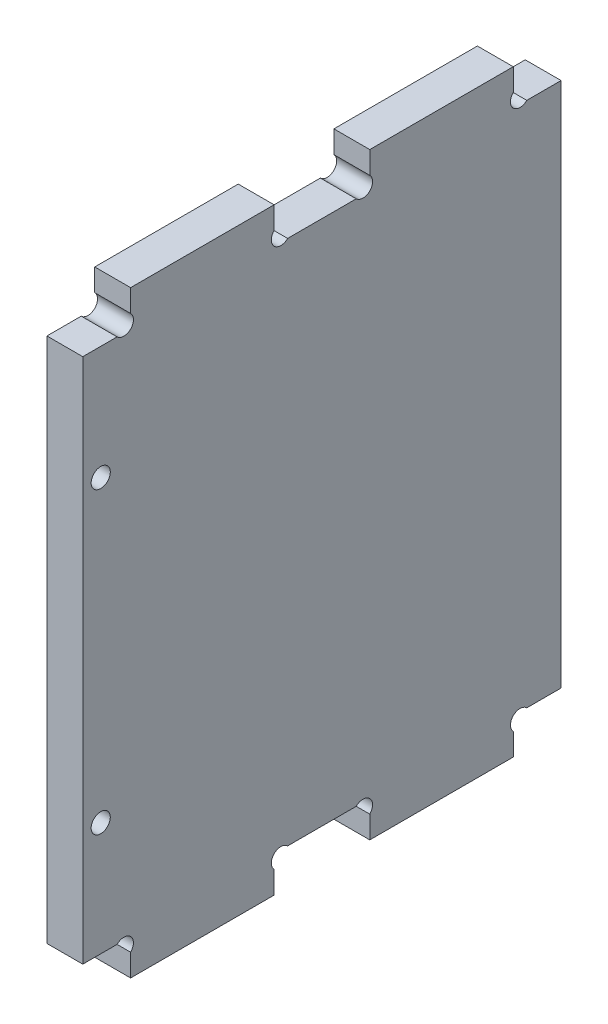
ISO-10303-21;
HEADER;
FILE_DESCRIPTION(('STEP AP214'),'2;1');
FILE_NAME('part.step','',(''),(''),'','','');
FILE_SCHEMA(('AUTOMOTIVE_DESIGN { 1 0 10303 214 1 1 1 1 }'));
ENDSEC;
DATA;
#1=APPLICATION_CONTEXT('core data for automotive mechanical design processes');
#2=APPLICATION_PROTOCOL_DEFINITION('international standard','automotive_design',2000,#1);
#3=PRODUCT_CONTEXT('',#1,'mechanical');
#4=PRODUCT('Part','Part','',(#3));
#5=PRODUCT_RELATED_PRODUCT_CATEGORY('part','',(#4));
#6=PRODUCT_DEFINITION_FORMATION('','',#4);
#7=PRODUCT_DEFINITION_CONTEXT('part definition',#1,'design');
#8=PRODUCT_DEFINITION('design','',#6,#7);
#9=PRODUCT_DEFINITION_SHAPE('','',#8);
#10=(LENGTH_UNIT() NAMED_UNIT(*) SI_UNIT(.MILLI.,.METRE.));
#11=(NAMED_UNIT(*) PLANE_ANGLE_UNIT() SI_UNIT($,.RADIAN.));
#12=(NAMED_UNIT(*) SI_UNIT($,.STERADIAN.) SOLID_ANGLE_UNIT());
#13=UNCERTAINTY_MEASURE_WITH_UNIT(LENGTH_MEASURE(1.E-05),#10,'distance_accuracy_value','');
#14=(GEOMETRIC_REPRESENTATION_CONTEXT(3) GLOBAL_UNCERTAINTY_ASSIGNED_CONTEXT((#13)) GLOBAL_UNIT_ASSIGNED_CONTEXT((#10,
#11,#12)) REPRESENTATION_CONTEXT('',''));
#15=CARTESIAN_POINT('',(0.,0.,0.));
#16=DIRECTION('',(0.,0.,1.));
#17=DIRECTION('',(1.,0.,0.));
#18=AXIS2_PLACEMENT_3D('',#15,#16,#17);
#19=CARTESIAN_POINT('',(6.,95.1313708498985,-6.86862915010144));
#20=DIRECTION('',(1.,0.,0.));
#21=DIRECTION('',(0.,0.,-1.));
#22=AXIS2_PLACEMENT_3D('',#19,#20,#21);
#23=PLANE('',#22);
#24=CARTESIAN_POINT('',(6.,25.,-3.));
#25=DIRECTION('',(1.,0.,0.));
#26=DIRECTION('',(0.,0.,-1.));
#27=AXIS2_PLACEMENT_3D('',#24,#25,#26);
#28=CIRCLE('',#27,1.6);
#29=CARTESIAN_POINT('',(6.,25.,-4.6));
#30=VERTEX_POINT('',#29);
#31=EDGE_CURVE('E230',#30,#30,#28,.T.);
#32=ORIENTED_EDGE('',*,*,#31,.F.);
#33=EDGE_LOOP('',(#32));
#34=FACE_BOUND('',#33,.T.);
#35=CARTESIAN_POINT('',(6.,95.1313708498985,-6.86862915010144));
#36=DIRECTION('',(-1.,0.,0.));
#37=DIRECTION('',(0.,0.,-1.));
#38=AXIS2_PLACEMENT_3D('',#35,#36,#37);
#39=CIRCLE('',#38,1.60000000000011);
#40=CARTESIAN_POINT('',(6.,96.2627416997971,-8.00000000000001));
#41=VERTEX_POINT('',#40);
#42=CARTESIAN_POINT('',(6.,94.,-5.73725830020288));
#43=VERTEX_POINT('',#42);
#44=EDGE_CURVE('E288',#41,#43,#39,.T.);
#45=ORIENTED_EDGE('',*,*,#44,.T.);
#46=DIRECTION('',(0.,0.,1.));
#47=VECTOR('',#46,1.);
#48=CARTESIAN_POINT('',(6.,94.,0.));
#49=LINE('',#48,#47);
#50=CARTESIAN_POINT('',(6.,94.,0.));
#51=VERTEX_POINT('',#50);
#52=EDGE_CURVE('E225',#43,#51,#49,.T.);
#53=ORIENTED_EDGE('',*,*,#52,.T.);
#54=DIRECTION('',(0.,-1.,0.));
#55=VECTOR('',#54,1.);
#56=CARTESIAN_POINT('',(6.,6.00000000000003,0.));
#57=LINE('',#56,#55);
#58=CARTESIAN_POINT('',(6.,6.00000000000003,0.));
#59=VERTEX_POINT('',#58);
#60=EDGE_CURVE('E291',#51,#59,#57,.T.);
#61=ORIENTED_EDGE('',*,*,#60,.T.);
#62=DIRECTION('',(0.,0.,-1.));
#63=VECTOR('',#62,1.);
#64=CARTESIAN_POINT('',(6.,6.00000000000003,0.));
#65=LINE('',#64,#63);
#66=CARTESIAN_POINT('',(6.,6.00000000000002,-5.7372583002029));
#67=VERTEX_POINT('',#66);
#68=EDGE_CURVE('E293',#59,#67,#65,.T.);
#69=ORIENTED_EDGE('',*,*,#68,.T.);
#70=CARTESIAN_POINT('',(6.,4.86862915010146,-6.86862915010143));
#71=DIRECTION('',(-1.,0.,0.));
#72=DIRECTION('',(0.,0.,1.));
#73=AXIS2_PLACEMENT_3D('',#70,#71,#72);
#74=CIRCLE('',#73,1.6000000000001);
#75=CARTESIAN_POINT('',(6.,3.73725830020293,-8.));
#76=VERTEX_POINT('',#75);
#77=EDGE_CURVE('E295',#67,#76,#74,.T.);
#78=ORIENTED_EDGE('',*,*,#77,.T.);
#79=DIRECTION('',(0.,-1.,0.));
#80=VECTOR('',#79,1.);
#81=CARTESIAN_POINT('',(6.,3.73725830020293,-8.00000000000001));
#82=LINE('',#81,#80);
#83=CARTESIAN_POINT('',(6.,0.,-8.));
#84=VERTEX_POINT('',#83);
#85=EDGE_CURVE('E297',#76,#84,#82,.T.);
#86=ORIENTED_EDGE('',*,*,#85,.T.);
#87=DIRECTION('',(0.,0.,-1.));
#88=VECTOR('',#87,1.);
#89=CARTESIAN_POINT('',(6.,0.,-8.));
#90=LINE('',#89,#88);
#91=CARTESIAN_POINT('',(6.,0.,-32.));
#92=VERTEX_POINT('',#91);
#93=EDGE_CURVE('E299',#84,#92,#90,.T.);
#94=ORIENTED_EDGE('',*,*,#93,.T.);
#95=DIRECTION('',(0.,1.,0.));
#96=VECTOR('',#95,1.);
#97=CARTESIAN_POINT('',(6.,0.,-32.));
#98=LINE('',#97,#96);
#99=CARTESIAN_POINT('',(6.,3.73725830020294,-32.));
#100=VERTEX_POINT('',#99);
#101=EDGE_CURVE('E301',#92,#100,#98,.T.);
#102=ORIENTED_EDGE('',*,*,#101,.T.);
#103=CARTESIAN_POINT('',(6.,4.86862915010146,-33.1313708498986));
#104=DIRECTION('',(-1.,0.,0.));
#105=DIRECTION('',(0.,0.,-1.));
#106=AXIS2_PLACEMENT_3D('',#103,#104,#105);
#107=CIRCLE('',#106,1.6000000000001);
#108=CARTESIAN_POINT('',(6.,6.00000000000003,-34.2627416997971));
#109=VERTEX_POINT('',#108);
#110=EDGE_CURVE('E303',#100,#109,#107,.T.);
#111=ORIENTED_EDGE('',*,*,#110,.T.);
#112=DIRECTION('',(0.,0.,-1.));
#113=VECTOR('',#112,1.);
#114=CARTESIAN_POINT('',(6.,6.00000000000002,-34.2627416997971));
#115=LINE('',#114,#113);
#116=CARTESIAN_POINT('',(6.,6.00000000000002,-45.7372583002029));
#117=VERTEX_POINT('',#116);
#118=EDGE_CURVE('E305',#109,#117,#115,.T.);
#119=ORIENTED_EDGE('',*,*,#118,.T.);
#120=CARTESIAN_POINT('',(6.,4.86862915010146,-46.8686291501014));
#121=DIRECTION('',(-1.,0.,0.));
#122=DIRECTION('',(0.,0.,1.));
#123=AXIS2_PLACEMENT_3D('',#120,#121,#122);
#124=CIRCLE('',#123,1.6000000000001);
#125=CARTESIAN_POINT('',(6.,3.73725830020294,-48.));
#126=VERTEX_POINT('',#125);
#127=EDGE_CURVE('E307',#117,#126,#124,.T.);
#128=ORIENTED_EDGE('',*,*,#127,.T.);
#129=DIRECTION('',(0.,-1.,0.));
#130=VECTOR('',#129,1.);
#131=CARTESIAN_POINT('',(6.,0.,-48.));
#132=LINE('',#131,#130);
#133=CARTESIAN_POINT('',(6.,0.,-48.));
#134=VERTEX_POINT('',#133);
#135=EDGE_CURVE('E309',#126,#134,#132,.T.);
#136=ORIENTED_EDGE('',*,*,#135,.T.);
#137=DIRECTION('',(0.,0.,-1.));
#138=VECTOR('',#137,1.);
#139=CARTESIAN_POINT('',(6.,0.,-72.));
#140=LINE('',#139,#138);
#141=CARTESIAN_POINT('',(6.,0.,-72.));
#142=VERTEX_POINT('',#141);
#143=EDGE_CURVE('E311',#134,#142,#140,.T.);
#144=ORIENTED_EDGE('',*,*,#143,.T.);
#145=DIRECTION('',(0.,1.,0.));
#146=VECTOR('',#145,1.);
#147=CARTESIAN_POINT('',(6.,3.73725830020293,-72.));
#148=LINE('',#147,#146);
#149=CARTESIAN_POINT('',(6.,3.73725830020293,-72.));
#150=VERTEX_POINT('',#149);
#151=EDGE_CURVE('E313',#142,#150,#148,.T.);
#152=ORIENTED_EDGE('',*,*,#151,.T.);
#153=CARTESIAN_POINT('',(6.,4.86862915010146,-73.1313708498986));
#154=DIRECTION('',(-1.,0.,0.));
#155=DIRECTION('',(0.,0.,-1.));
#156=AXIS2_PLACEMENT_3D('',#153,#154,#155);
#157=CIRCLE('',#156,1.6000000000001);
#158=CARTESIAN_POINT('',(6.,6.00000000000002,-74.2627416997971));
#159=VERTEX_POINT('',#158);
#160=EDGE_CURVE('E315',#150,#159,#157,.T.);
#161=ORIENTED_EDGE('',*,*,#160,.T.);
#162=DIRECTION('',(0.,0.,-1.));
#163=VECTOR('',#162,1.);
#164=CARTESIAN_POINT('',(6.,6.,-80.));
#165=LINE('',#164,#163);
#166=CARTESIAN_POINT('',(6.,6.,-80.));
#167=VERTEX_POINT('',#166);
#168=EDGE_CURVE('E317',#159,#167,#165,.T.);
#169=ORIENTED_EDGE('',*,*,#168,.T.);
#170=DIRECTION('',(0.,1.,0.));
#171=VECTOR('',#170,1.);
#172=CARTESIAN_POINT('',(6.,94.,-80.));
#173=LINE('',#172,#171);
#174=CARTESIAN_POINT('',(6.,94.,-80.));
#175=VERTEX_POINT('',#174);
#176=EDGE_CURVE('E319',#167,#175,#173,.T.);
#177=ORIENTED_EDGE('',*,*,#176,.T.);
#178=DIRECTION('',(0.,0.,1.));
#179=VECTOR('',#178,1.);
#180=CARTESIAN_POINT('',(6.,94.,-80.));
#181=LINE('',#180,#179);
#182=CARTESIAN_POINT('',(6.,94.,-74.2627416997971));
#183=VERTEX_POINT('',#182);
#184=EDGE_CURVE('E321',#175,#183,#181,.T.);
#185=ORIENTED_EDGE('',*,*,#184,.T.);
#186=CARTESIAN_POINT('',(6.,95.1313708498985,-73.1313708498986));
#187=DIRECTION('',(-1.,0.,0.));
#188=DIRECTION('',(0.,0.,1.));
#189=AXIS2_PLACEMENT_3D('',#186,#187,#188);
#190=CIRCLE('',#189,1.60000000000011);
#191=CARTESIAN_POINT('',(6.,96.2627416997971,-72.));
#192=VERTEX_POINT('',#191);
#193=EDGE_CURVE('E323',#183,#192,#190,.T.);
#194=ORIENTED_EDGE('',*,*,#193,.T.);
#195=DIRECTION('',(0.,1.,0.));
#196=VECTOR('',#195,1.);
#197=CARTESIAN_POINT('',(6.,96.2627416997971,-72.));
#198=LINE('',#197,#196);
#199=CARTESIAN_POINT('',(6.,100.,-72.));
#200=VERTEX_POINT('',#199);
#201=EDGE_CURVE('E325',#192,#200,#198,.T.);
#202=ORIENTED_EDGE('',*,*,#201,.T.);
#203=DIRECTION('',(0.,0.,1.));
#204=VECTOR('',#203,1.);
#205=CARTESIAN_POINT('',(6.,100.,-72.));
#206=LINE('',#205,#204);
#207=CARTESIAN_POINT('',(6.,100.,-48.));
#208=VERTEX_POINT('',#207);
#209=EDGE_CURVE('E327',#200,#208,#206,.T.);
#210=ORIENTED_EDGE('',*,*,#209,.T.);
#211=DIRECTION('',(0.,-1.,0.));
#212=VECTOR('',#211,1.);
#213=CARTESIAN_POINT('',(6.,100.,-48.));
#214=LINE('',#213,#212);
#215=CARTESIAN_POINT('',(6.,96.2627416997971,-48.));
#216=VERTEX_POINT('',#215);
#217=EDGE_CURVE('E329',#208,#216,#214,.T.);
#218=ORIENTED_EDGE('',*,*,#217,.T.);
#219=CARTESIAN_POINT('',(6.,95.1313708498985,-46.8686291501014));
#220=DIRECTION('',(-1.,0.,0.));
#221=DIRECTION('',(0.,0.,-1.));
#222=AXIS2_PLACEMENT_3D('',#219,#220,#221);
#223=CIRCLE('',#222,1.6000000000001);
#224=CARTESIAN_POINT('',(6.,94.,-45.7372583002029));
#225=VERTEX_POINT('',#224);
#226=EDGE_CURVE('E331',#216,#225,#223,.T.);
#227=ORIENTED_EDGE('',*,*,#226,.T.);
#228=DIRECTION('',(0.,0.,1.));
#229=VECTOR('',#228,1.);
#230=CARTESIAN_POINT('',(6.,94.,-34.2627416997971));
#231=LINE('',#230,#229);
#232=CARTESIAN_POINT('',(6.,94.,-34.2627416997971));
#233=VERTEX_POINT('',#232);
#234=EDGE_CURVE('E333',#225,#233,#231,.T.);
#235=ORIENTED_EDGE('',*,*,#234,.T.);
#236=CARTESIAN_POINT('',(6.,95.1313708498985,-33.1313708498986));
#237=DIRECTION('',(-1.,0.,0.));
#238=DIRECTION('',(0.,0.,1.));
#239=AXIS2_PLACEMENT_3D('',#236,#237,#238);
#240=CIRCLE('',#239,1.6000000000001);
#241=CARTESIAN_POINT('',(6.,96.2627416997971,-32.));
#242=VERTEX_POINT('',#241);
#243=EDGE_CURVE('E335',#233,#242,#240,.T.);
#244=ORIENTED_EDGE('',*,*,#243,.T.);
#245=DIRECTION('',(0.,1.,0.));
#246=VECTOR('',#245,1.);
#247=CARTESIAN_POINT('',(6.,100.,-32.));
#248=LINE('',#247,#246);
#249=CARTESIAN_POINT('',(6.,100.,-32.));
#250=VERTEX_POINT('',#249);
#251=EDGE_CURVE('E337',#242,#250,#248,.T.);
#252=ORIENTED_EDGE('',*,*,#251,.T.);
#253=DIRECTION('',(0.,0.,1.));
#254=VECTOR('',#253,1.);
#255=CARTESIAN_POINT('',(6.,100.,-8.));
#256=LINE('',#255,#254);
#257=CARTESIAN_POINT('',(6.,100.,-8.));
#258=VERTEX_POINT('',#257);
#259=EDGE_CURVE('E46',#250,#258,#256,.T.);
#260=ORIENTED_EDGE('',*,*,#259,.T.);
#261=DIRECTION('',(0.,-1.,0.));
#262=VECTOR('',#261,1.);
#263=CARTESIAN_POINT('',(6.,96.2627416997971,-8.00000000000001));
#264=LINE('',#263,#262);
#265=EDGE_CURVE('E41',#258,#41,#264,.T.);
#266=ORIENTED_EDGE('',*,*,#265,.T.);
#267=EDGE_LOOP('',(#45,#53,#61,#69,#78,#86,#94,#102,#111,#119,#128,#136,#144,#152,#161,#169,
#177,#185,#194,#202,#210,#218,#227,#235,#244,#252,#260,#266));
#268=FACE_BOUND('',#267,.T.);
#269=CARTESIAN_POINT('',(6.,75.,-3.));
#270=DIRECTION('',(1.,0.,0.));
#271=DIRECTION('',(0.,0.,1.));
#272=AXIS2_PLACEMENT_3D('',#269,#270,#271);
#273=CIRCLE('',#272,1.6);
#274=CARTESIAN_POINT('',(6.,75.,-1.4));
#275=VERTEX_POINT('',#274);
#276=EDGE_CURVE('E568',#275,#275,#273,.T.);
#277=ORIENTED_EDGE('',*,*,#276,.F.);
#278=EDGE_LOOP('',(#277));
#279=FACE_BOUND('',#278,.T.);
#280=ADVANCED_FACE('F26',(#34,#268,#279),#23,.T.);
#281=CARTESIAN_POINT('',(0.,95.1313708498985,-6.86862915010144));
#282=DIRECTION('',(1.,0.,0.));
#283=DIRECTION('',(0.,0.,-1.));
#284=AXIS2_PLACEMENT_3D('',#281,#282,#283);
#285=PLANE('',#284);
#286=CARTESIAN_POINT('',(0.,25.,-3.));
#287=DIRECTION('',(1.,0.,0.));
#288=DIRECTION('',(0.,0.,-1.));
#289=AXIS2_PLACEMENT_3D('',#286,#287,#288);
#290=CIRCLE('',#289,1.6);
#291=CARTESIAN_POINT('',(0.,25.,-4.6));
#292=VERTEX_POINT('',#291);
#293=EDGE_CURVE('E233',#292,#292,#290,.T.);
#294=ORIENTED_EDGE('',*,*,#293,.T.);
#295=EDGE_LOOP('',(#294));
#296=FACE_BOUND('',#295,.T.);
#297=CARTESIAN_POINT('',(0.,95.1313708498985,-6.86862915010144));
#298=DIRECTION('',(-1.,0.,0.));
#299=DIRECTION('',(0.,0.,-1.));
#300=AXIS2_PLACEMENT_3D('',#297,#298,#299);
#301=CIRCLE('',#300,1.60000000000011);
#302=CARTESIAN_POINT('',(0.,96.2627416997971,-8.00000000000001));
#303=VERTEX_POINT('',#302);
#304=CARTESIAN_POINT('',(0.,94.,-5.73725830020288));
#305=VERTEX_POINT('',#304);
#306=EDGE_CURVE('E216',#303,#305,#301,.T.);
#307=ORIENTED_EDGE('',*,*,#306,.F.);
#308=DIRECTION('',(0.,-1.,0.));
#309=VECTOR('',#308,1.);
#310=CARTESIAN_POINT('',(0.,96.2627416997971,-8.00000000000001));
#311=LINE('',#310,#309);
#312=CARTESIAN_POINT('',(0.,100.,-8.));
#313=VERTEX_POINT('',#312);
#314=EDGE_CURVE('E286',#313,#303,#311,.T.);
#315=ORIENTED_EDGE('',*,*,#314,.F.);
#316=DIRECTION('',(0.,0.,1.));
#317=VECTOR('',#316,1.);
#318=CARTESIAN_POINT('',(0.,100.,-8.));
#319=LINE('',#318,#317);
#320=CARTESIAN_POINT('',(0.,100.,-32.));
#321=VERTEX_POINT('',#320);
#322=EDGE_CURVE('E284',#321,#313,#319,.T.);
#323=ORIENTED_EDGE('',*,*,#322,.F.);
#324=DIRECTION('',(0.,1.,0.));
#325=VECTOR('',#324,1.);
#326=CARTESIAN_POINT('',(0.,100.,-32.));
#327=LINE('',#326,#325);
#328=CARTESIAN_POINT('',(0.,96.2627416997971,-32.));
#329=VERTEX_POINT('',#328);
#330=EDGE_CURVE('E282',#329,#321,#327,.T.);
#331=ORIENTED_EDGE('',*,*,#330,.F.);
#332=CARTESIAN_POINT('',(0.,95.1313708498985,-33.1313708498986));
#333=DIRECTION('',(-1.,0.,0.));
#334=DIRECTION('',(0.,0.,1.));
#335=AXIS2_PLACEMENT_3D('',#332,#333,#334);
#336=CIRCLE('',#335,1.6000000000001);
#337=CARTESIAN_POINT('',(0.,94.,-34.2627416997971));
#338=VERTEX_POINT('',#337);
#339=EDGE_CURVE('E280',#338,#329,#336,.T.);
#340=ORIENTED_EDGE('',*,*,#339,.F.);
#341=DIRECTION('',(0.,0.,1.));
#342=VECTOR('',#341,1.);
#343=CARTESIAN_POINT('',(0.,94.,-34.2627416997971));
#344=LINE('',#343,#342);
#345=CARTESIAN_POINT('',(0.,94.,-45.7372583002029));
#346=VERTEX_POINT('',#345);
#347=EDGE_CURVE('E278',#346,#338,#344,.T.);
#348=ORIENTED_EDGE('',*,*,#347,.F.);
#349=CARTESIAN_POINT('',(0.,95.1313708498985,-46.8686291501014));
#350=DIRECTION('',(-1.,0.,0.));
#351=DIRECTION('',(0.,0.,-1.));
#352=AXIS2_PLACEMENT_3D('',#349,#350,#351);
#353=CIRCLE('',#352,1.6000000000001);
#354=CARTESIAN_POINT('',(0.,96.2627416997971,-48.));
#355=VERTEX_POINT('',#354);
#356=EDGE_CURVE('E276',#355,#346,#353,.T.);
#357=ORIENTED_EDGE('',*,*,#356,.F.);
#358=DIRECTION('',(0.,-1.,0.));
#359=VECTOR('',#358,1.);
#360=CARTESIAN_POINT('',(0.,100.,-48.));
#361=LINE('',#360,#359);
#362=CARTESIAN_POINT('',(0.,100.,-48.));
#363=VERTEX_POINT('',#362);
#364=EDGE_CURVE('E274',#363,#355,#361,.T.);
#365=ORIENTED_EDGE('',*,*,#364,.F.);
#366=DIRECTION('',(0.,0.,1.));
#367=VECTOR('',#366,1.);
#368=CARTESIAN_POINT('',(0.,100.,-72.));
#369=LINE('',#368,#367);
#370=CARTESIAN_POINT('',(0.,100.,-72.));
#371=VERTEX_POINT('',#370);
#372=EDGE_CURVE('E272',#371,#363,#369,.T.);
#373=ORIENTED_EDGE('',*,*,#372,.F.);
#374=DIRECTION('',(0.,1.,0.));
#375=VECTOR('',#374,1.);
#376=CARTESIAN_POINT('',(0.,96.2627416997971,-72.));
#377=LINE('',#376,#375);
#378=CARTESIAN_POINT('',(0.,96.2627416997971,-72.));
#379=VERTEX_POINT('',#378);
#380=EDGE_CURVE('E270',#379,#371,#377,.T.);
#381=ORIENTED_EDGE('',*,*,#380,.F.);
#382=CARTESIAN_POINT('',(0.,95.1313708498985,-73.1313708498986));
#383=DIRECTION('',(-1.,0.,0.));
#384=DIRECTION('',(0.,0.,1.));
#385=AXIS2_PLACEMENT_3D('',#382,#383,#384);
#386=CIRCLE('',#385,1.60000000000011);
#387=CARTESIAN_POINT('',(0.,94.,-74.2627416997971));
#388=VERTEX_POINT('',#387);
#389=EDGE_CURVE('E268',#388,#379,#386,.T.);
#390=ORIENTED_EDGE('',*,*,#389,.F.);
#391=DIRECTION('',(0.,0.,1.));
#392=VECTOR('',#391,1.);
#393=CARTESIAN_POINT('',(0.,94.,-80.));
#394=LINE('',#393,#392);
#395=CARTESIAN_POINT('',(0.,94.,-80.));
#396=VERTEX_POINT('',#395);
#397=EDGE_CURVE('E266',#396,#388,#394,.T.);
#398=ORIENTED_EDGE('',*,*,#397,.F.);
#399=DIRECTION('',(0.,1.,0.));
#400=VECTOR('',#399,1.);
#401=CARTESIAN_POINT('',(0.,94.,-80.));
#402=LINE('',#401,#400);
#403=CARTESIAN_POINT('',(0.,6.,-80.));
#404=VERTEX_POINT('',#403);
#405=EDGE_CURVE('E264',#404,#396,#402,.T.);
#406=ORIENTED_EDGE('',*,*,#405,.F.);
#407=DIRECTION('',(0.,0.,-1.));
#408=VECTOR('',#407,1.);
#409=CARTESIAN_POINT('',(0.,6.,-80.));
#410=LINE('',#409,#408);
#411=CARTESIAN_POINT('',(0.,6.00000000000002,-74.2627416997971));
#412=VERTEX_POINT('',#411);
#413=EDGE_CURVE('E262',#412,#404,#410,.T.);
#414=ORIENTED_EDGE('',*,*,#413,.F.);
#415=CARTESIAN_POINT('',(0.,4.86862915010146,-73.1313708498986));
#416=DIRECTION('',(-1.,0.,0.));
#417=DIRECTION('',(0.,0.,-1.));
#418=AXIS2_PLACEMENT_3D('',#415,#416,#417);
#419=CIRCLE('',#418,1.6000000000001);
#420=CARTESIAN_POINT('',(0.,3.73725830020293,-72.));
#421=VERTEX_POINT('',#420);
#422=EDGE_CURVE('E260',#421,#412,#419,.T.);
#423=ORIENTED_EDGE('',*,*,#422,.F.);
#424=DIRECTION('',(0.,1.,0.));
#425=VECTOR('',#424,1.);
#426=CARTESIAN_POINT('',(0.,3.73725830020293,-72.));
#427=LINE('',#426,#425);
#428=CARTESIAN_POINT('',(0.,0.,-72.));
#429=VERTEX_POINT('',#428);
#430=EDGE_CURVE('E258',#429,#421,#427,.T.);
#431=ORIENTED_EDGE('',*,*,#430,.F.);
#432=DIRECTION('',(0.,0.,-1.));
#433=VECTOR('',#432,1.);
#434=CARTESIAN_POINT('',(0.,0.,-72.));
#435=LINE('',#434,#433);
#436=CARTESIAN_POINT('',(0.,0.,-48.));
#437=VERTEX_POINT('',#436);
#438=EDGE_CURVE('E256',#437,#429,#435,.T.);
#439=ORIENTED_EDGE('',*,*,#438,.F.);
#440=DIRECTION('',(0.,-1.,0.));
#441=VECTOR('',#440,1.);
#442=CARTESIAN_POINT('',(0.,0.,-48.));
#443=LINE('',#442,#441);
#444=CARTESIAN_POINT('',(0.,3.73725830020294,-48.));
#445=VERTEX_POINT('',#444);
#446=EDGE_CURVE('E254',#445,#437,#443,.T.);
#447=ORIENTED_EDGE('',*,*,#446,.F.);
#448=CARTESIAN_POINT('',(0.,4.86862915010146,-46.8686291501014));
#449=DIRECTION('',(-1.,0.,0.));
#450=DIRECTION('',(0.,0.,1.));
#451=AXIS2_PLACEMENT_3D('',#448,#449,#450);
#452=CIRCLE('',#451,1.6000000000001);
#453=CARTESIAN_POINT('',(0.,6.00000000000002,-45.7372583002029));
#454=VERTEX_POINT('',#453);
#455=EDGE_CURVE('E252',#454,#445,#452,.T.);
#456=ORIENTED_EDGE('',*,*,#455,.F.);
#457=DIRECTION('',(0.,0.,-1.));
#458=VECTOR('',#457,1.);
#459=CARTESIAN_POINT('',(0.,6.00000000000002,-34.2627416997971));
#460=LINE('',#459,#458);
#461=CARTESIAN_POINT('',(0.,6.00000000000003,-34.2627416997971));
#462=VERTEX_POINT('',#461);
#463=EDGE_CURVE('E250',#462,#454,#460,.T.);
#464=ORIENTED_EDGE('',*,*,#463,.F.);
#465=CARTESIAN_POINT('',(0.,4.86862915010146,-33.1313708498986));
#466=DIRECTION('',(-1.,0.,0.));
#467=DIRECTION('',(0.,0.,-1.));
#468=AXIS2_PLACEMENT_3D('',#465,#466,#467);
#469=CIRCLE('',#468,1.6000000000001);
#470=CARTESIAN_POINT('',(0.,3.73725830020294,-32.));
#471=VERTEX_POINT('',#470);
#472=EDGE_CURVE('E248',#471,#462,#469,.T.);
#473=ORIENTED_EDGE('',*,*,#472,.F.);
#474=DIRECTION('',(0.,1.,0.));
#475=VECTOR('',#474,1.);
#476=CARTESIAN_POINT('',(0.,0.,-32.));
#477=LINE('',#476,#475);
#478=CARTESIAN_POINT('',(0.,0.,-32.));
#479=VERTEX_POINT('',#478);
#480=EDGE_CURVE('E246',#479,#471,#477,.T.);
#481=ORIENTED_EDGE('',*,*,#480,.F.);
#482=DIRECTION('',(0.,0.,-1.));
#483=VECTOR('',#482,1.);
#484=CARTESIAN_POINT('',(0.,0.,-8.));
#485=LINE('',#484,#483);
#486=CARTESIAN_POINT('',(0.,0.,-8.));
#487=VERTEX_POINT('',#486);
#488=EDGE_CURVE('E244',#487,#479,#485,.T.);
#489=ORIENTED_EDGE('',*,*,#488,.F.);
#490=DIRECTION('',(0.,-1.,0.));
#491=VECTOR('',#490,1.);
#492=CARTESIAN_POINT('',(0.,3.73725830020293,-8.00000000000001));
#493=LINE('',#492,#491);
#494=CARTESIAN_POINT('',(0.,3.73725830020293,-8.));
#495=VERTEX_POINT('',#494);
#496=EDGE_CURVE('E242',#495,#487,#493,.T.);
#497=ORIENTED_EDGE('',*,*,#496,.F.);
#498=CARTESIAN_POINT('',(0.,4.86862915010146,-6.86862915010143));
#499=DIRECTION('',(-1.,0.,0.));
#500=DIRECTION('',(0.,0.,1.));
#501=AXIS2_PLACEMENT_3D('',#498,#499,#500);
#502=CIRCLE('',#501,1.6000000000001);
#503=CARTESIAN_POINT('',(0.,6.00000000000002,-5.7372583002029));
#504=VERTEX_POINT('',#503);
#505=EDGE_CURVE('E240',#504,#495,#502,.T.);
#506=ORIENTED_EDGE('',*,*,#505,.F.);
#507=DIRECTION('',(0.,0.,-1.));
#508=VECTOR('',#507,1.);
#509=CARTESIAN_POINT('',(0.,6.00000000000003,0.));
#510=LINE('',#509,#508);
#511=CARTESIAN_POINT('',(0.,6.00000000000003,0.));
#512=VERTEX_POINT('',#511);
#513=EDGE_CURVE('E238',#512,#504,#510,.T.);
#514=ORIENTED_EDGE('',*,*,#513,.F.);
#515=DIRECTION('',(0.,-1.,0.));
#516=VECTOR('',#515,1.);
#517=CARTESIAN_POINT('',(0.,6.00000000000003,0.));
#518=LINE('',#517,#516);
#519=CARTESIAN_POINT('',(0.,94.,0.));
#520=VERTEX_POINT('',#519);
#521=EDGE_CURVE('E218',#520,#512,#518,.T.);
#522=ORIENTED_EDGE('',*,*,#521,.F.);
#523=DIRECTION('',(0.,0.,1.));
#524=VECTOR('',#523,1.);
#525=CARTESIAN_POINT('',(0.,94.,0.));
#526=LINE('',#525,#524);
#527=EDGE_CURVE('E211',#305,#520,#526,.T.);
#528=ORIENTED_EDGE('',*,*,#527,.F.);
#529=EDGE_LOOP('',(#307,#315,#323,#331,#340,#348,#357,#365,#373,#381,#390,#398,#406,#414,#423,
#431,#439,#447,#456,#464,#473,#481,#489,#497,#506,#514,#522,#528));
#530=FACE_BOUND('',#529,.T.);
#531=CARTESIAN_POINT('',(0.,75.,-3.));
#532=DIRECTION('',(1.,0.,0.));
#533=DIRECTION('',(0.,0.,1.));
#534=AXIS2_PLACEMENT_3D('',#531,#532,#533);
#535=CIRCLE('',#534,1.6);
#536=CARTESIAN_POINT('',(0.,75.,-1.4));
#537=VERTEX_POINT('',#536);
#538=EDGE_CURVE('E571',#537,#537,#535,.T.);
#539=ORIENTED_EDGE('',*,*,#538,.T.);
#540=EDGE_LOOP('',(#539));
#541=FACE_BOUND('',#540,.T.);
#542=ADVANCED_FACE('F212',(#296,#530,#541),#285,.F.);
#543=CARTESIAN_POINT('',(6.,95.1313708498985,-6.86862915010144));
#544=DIRECTION('',(-1.,0.,0.));
#545=DIRECTION('',(0.,0.,1.));
#546=AXIS2_PLACEMENT_3D('',#543,#544,#545);
#547=CYLINDRICAL_SURFACE('',#546,1.60000000000011);
#548=ORIENTED_EDGE('',*,*,#306,.T.);
#549=DIRECTION('',(-1.,0.,0.));
#550=VECTOR('',#549,1.);
#551=CARTESIAN_POINT('',(6.,94.,-5.73725830020288));
#552=LINE('',#551,#550);
#553=EDGE_CURVE('E11',#43,#305,#552,.T.);
#554=ORIENTED_EDGE('',*,*,#553,.F.);
#555=ORIENTED_EDGE('',*,*,#44,.F.);
#556=DIRECTION('',(-1.,0.,0.));
#557=VECTOR('',#556,1.);
#558=CARTESIAN_POINT('',(6.,96.2627416997971,-8.00000000000001));
#559=LINE('',#558,#557);
#560=EDGE_CURVE('E229',#41,#303,#559,.T.);
#561=ORIENTED_EDGE('',*,*,#560,.T.);
#562=EDGE_LOOP('',(#548,#554,#555,#561));
#563=FACE_BOUND('',#562,.T.);
#564=ADVANCED_FACE('F28',(#563),#547,.F.);
#565=CARTESIAN_POINT('',(6.,94.,0.));
#566=DIRECTION('',(0.,-1.,0.));
#567=DIRECTION('',(0.,0.,-1.));
#568=AXIS2_PLACEMENT_3D('',#565,#566,#567);
#569=PLANE('',#568);
#570=ORIENTED_EDGE('',*,*,#527,.T.);
#571=DIRECTION('',(-1.,0.,0.));
#572=VECTOR('',#571,1.);
#573=CARTESIAN_POINT('',(6.,94.,0.));
#574=LINE('',#573,#572);
#575=EDGE_CURVE('E34',#51,#520,#574,.T.);
#576=ORIENTED_EDGE('',*,*,#575,.F.);
#577=ORIENTED_EDGE('',*,*,#52,.F.);
#578=ORIENTED_EDGE('',*,*,#553,.T.);
#579=EDGE_LOOP('',(#570,#576,#577,#578));
#580=FACE_BOUND('',#579,.T.);
#581=ADVANCED_FACE('F224',(#580),#569,.F.);
#582=CARTESIAN_POINT('',(6.,6.00000000000003,0.));
#583=DIRECTION('',(0.,0.,-1.));
#584=DIRECTION('',(0.,1.,0.));
#585=AXIS2_PLACEMENT_3D('',#582,#583,#584);
#586=PLANE('',#585);
#587=ORIENTED_EDGE('',*,*,#521,.T.);
#588=DIRECTION('',(-1.,0.,0.));
#589=VECTOR('',#588,1.);
#590=CARTESIAN_POINT('',(6.,6.00000000000003,0.));
#591=LINE('',#590,#589);
#592=EDGE_CURVE('E414',#59,#512,#591,.T.);
#593=ORIENTED_EDGE('',*,*,#592,.F.);
#594=ORIENTED_EDGE('',*,*,#60,.F.);
#595=ORIENTED_EDGE('',*,*,#575,.T.);
#596=EDGE_LOOP('',(#587,#593,#594,#595));
#597=FACE_BOUND('',#596,.T.);
#598=ADVANCED_FACE('F418',(#597),#586,.F.);
#599=CARTESIAN_POINT('',(6.,6.00000000000003,0.));
#600=DIRECTION('',(0.,1.,0.));
#601=DIRECTION('',(0.,0.,1.));
#602=AXIS2_PLACEMENT_3D('',#599,#600,#601);
#603=PLANE('',#602);
#604=ORIENTED_EDGE('',*,*,#513,.T.);
#605=DIRECTION('',(-1.,0.,0.));
#606=VECTOR('',#605,1.);
#607=CARTESIAN_POINT('',(6.,6.00000000000002,-5.7372583002029));
#608=LINE('',#607,#606);
#609=EDGE_CURVE('E411',#67,#504,#608,.T.);
#610=ORIENTED_EDGE('',*,*,#609,.F.);
#611=ORIENTED_EDGE('',*,*,#68,.F.);
#612=ORIENTED_EDGE('',*,*,#592,.T.);
#613=EDGE_LOOP('',(#604,#610,#611,#612));
#614=FACE_BOUND('',#613,.T.);
#615=ADVANCED_FACE('F426',(#614),#603,.F.);
#616=CARTESIAN_POINT('',(6.,4.86862915010146,-6.86862915010143));
#617=DIRECTION('',(-1.,0.,0.));
#618=DIRECTION('',(0.,0.,1.));
#619=AXIS2_PLACEMENT_3D('',#616,#617,#618);
#620=CYLINDRICAL_SURFACE('',#619,1.6000000000001);
#621=ORIENTED_EDGE('',*,*,#505,.T.);
#622=DIRECTION('',(-1.,0.,0.));
#623=VECTOR('',#622,1.);
#624=CARTESIAN_POINT('',(6.,3.73725830020293,-8.));
#625=LINE('',#624,#623);
#626=EDGE_CURVE('E408',#76,#495,#625,.T.);
#627=ORIENTED_EDGE('',*,*,#626,.F.);
#628=ORIENTED_EDGE('',*,*,#77,.F.);
#629=ORIENTED_EDGE('',*,*,#609,.T.);
#630=EDGE_LOOP('',(#621,#627,#628,#629));
#631=FACE_BOUND('',#630,.T.);
#632=ADVANCED_FACE('F429',(#631),#620,.F.);
#633=CARTESIAN_POINT('',(6.,3.73725830020293,-8.00000000000001));
#634=DIRECTION('',(0.,0.,-1.));
#635=DIRECTION('',(0.,1.,0.));
#636=AXIS2_PLACEMENT_3D('',#633,#634,#635);
#637=PLANE('',#636);
#638=ORIENTED_EDGE('',*,*,#496,.T.);
#639=DIRECTION('',(-1.,0.,0.));
#640=VECTOR('',#639,1.);
#641=CARTESIAN_POINT('',(6.,0.,-8.));
#642=LINE('',#641,#640);
#643=EDGE_CURVE('E405',#84,#487,#642,.T.);
#644=ORIENTED_EDGE('',*,*,#643,.F.);
#645=ORIENTED_EDGE('',*,*,#85,.F.);
#646=ORIENTED_EDGE('',*,*,#626,.T.);
#647=EDGE_LOOP('',(#638,#644,#645,#646));
#648=FACE_BOUND('',#647,.T.);
#649=ADVANCED_FACE('F434',(#648),#637,.F.);
#650=CARTESIAN_POINT('',(6.,0.,-8.));
#651=DIRECTION('',(0.,1.,0.));
#652=DIRECTION('',(0.,0.,1.));
#653=AXIS2_PLACEMENT_3D('',#650,#651,#652);
#654=PLANE('',#653);
#655=ORIENTED_EDGE('',*,*,#488,.T.);
#656=DIRECTION('',(-1.,0.,0.));
#657=VECTOR('',#656,1.);
#658=CARTESIAN_POINT('',(6.,0.,-32.));
#659=LINE('',#658,#657);
#660=EDGE_CURVE('E402',#92,#479,#659,.T.);
#661=ORIENTED_EDGE('',*,*,#660,.F.);
#662=ORIENTED_EDGE('',*,*,#93,.F.);
#663=ORIENTED_EDGE('',*,*,#643,.T.);
#664=EDGE_LOOP('',(#655,#661,#662,#663));
#665=FACE_BOUND('',#664,.T.);
#666=ADVANCED_FACE('F440',(#665),#654,.F.);
#667=CARTESIAN_POINT('',(6.,0.,-32.));
#668=DIRECTION('',(0.,0.,1.));
#669=DIRECTION('',(0.,-1.,0.));
#670=AXIS2_PLACEMENT_3D('',#667,#668,#669);
#671=PLANE('',#670);
#672=ORIENTED_EDGE('',*,*,#480,.T.);
#673=DIRECTION('',(-1.,0.,0.));
#674=VECTOR('',#673,1.);
#675=CARTESIAN_POINT('',(6.,3.73725830020294,-32.));
#676=LINE('',#675,#674);
#677=EDGE_CURVE('E399',#100,#471,#676,.T.);
#678=ORIENTED_EDGE('',*,*,#677,.F.);
#679=ORIENTED_EDGE('',*,*,#101,.F.);
#680=ORIENTED_EDGE('',*,*,#660,.T.);
#681=EDGE_LOOP('',(#672,#678,#679,#680));
#682=FACE_BOUND('',#681,.T.);
#683=ADVANCED_FACE('F444',(#682),#671,.F.);
#684=CARTESIAN_POINT('',(6.,4.86862915010146,-33.1313708498986));
#685=DIRECTION('',(-1.,0.,0.));
#686=DIRECTION('',(0.,0.,1.));
#687=AXIS2_PLACEMENT_3D('',#684,#685,#686);
#688=CYLINDRICAL_SURFACE('',#687,1.6000000000001);
#689=ORIENTED_EDGE('',*,*,#472,.T.);
#690=DIRECTION('',(-1.,0.,0.));
#691=VECTOR('',#690,1.);
#692=CARTESIAN_POINT('',(6.,6.00000000000003,-34.2627416997971));
#693=LINE('',#692,#691);
#694=EDGE_CURVE('E396',#109,#462,#693,.T.);
#695=ORIENTED_EDGE('',*,*,#694,.F.);
#696=ORIENTED_EDGE('',*,*,#110,.F.);
#697=ORIENTED_EDGE('',*,*,#677,.T.);
#698=EDGE_LOOP('',(#689,#695,#696,#697));
#699=FACE_BOUND('',#698,.T.);
#700=ADVANCED_FACE('F449',(#699),#688,.F.);
#701=CARTESIAN_POINT('',(6.,6.00000000000002,-34.2627416997971));
#702=DIRECTION('',(0.,1.,0.));
#703=DIRECTION('',(0.,0.,1.));
#704=AXIS2_PLACEMENT_3D('',#701,#702,#703);
#705=PLANE('',#704);
#706=ORIENTED_EDGE('',*,*,#463,.T.);
#707=DIRECTION('',(-1.,0.,0.));
#708=VECTOR('',#707,1.);
#709=CARTESIAN_POINT('',(6.,6.00000000000002,-45.7372583002029));
#710=LINE('',#709,#708);
#711=EDGE_CURVE('E393',#117,#454,#710,.T.);
#712=ORIENTED_EDGE('',*,*,#711,.F.);
#713=ORIENTED_EDGE('',*,*,#118,.F.);
#714=ORIENTED_EDGE('',*,*,#694,.T.);
#715=EDGE_LOOP('',(#706,#712,#713,#714));
#716=FACE_BOUND('',#715,.T.);
#717=ADVANCED_FACE('F455',(#716),#705,.F.);
#718=CARTESIAN_POINT('',(6.,4.86862915010146,-46.8686291501014));
#719=DIRECTION('',(-1.,0.,0.));
#720=DIRECTION('',(0.,0.,1.));
#721=AXIS2_PLACEMENT_3D('',#718,#719,#720);
#722=CYLINDRICAL_SURFACE('',#721,1.6000000000001);
#723=ORIENTED_EDGE('',*,*,#455,.T.);
#724=DIRECTION('',(-1.,0.,0.));
#725=VECTOR('',#724,1.);
#726=CARTESIAN_POINT('',(6.,3.73725830020294,-48.));
#727=LINE('',#726,#725);
#728=EDGE_CURVE('E390',#126,#445,#727,.T.);
#729=ORIENTED_EDGE('',*,*,#728,.F.);
#730=ORIENTED_EDGE('',*,*,#127,.F.);
#731=ORIENTED_EDGE('',*,*,#711,.T.);
#732=EDGE_LOOP('',(#723,#729,#730,#731));
#733=FACE_BOUND('',#732,.T.);
#734=ADVANCED_FACE('F459',(#733),#722,.F.);
#735=CARTESIAN_POINT('',(6.,0.,-48.));
#736=DIRECTION('',(0.,0.,-1.));
#737=DIRECTION('',(0.,1.,0.));
#738=AXIS2_PLACEMENT_3D('',#735,#736,#737);
#739=PLANE('',#738);
#740=ORIENTED_EDGE('',*,*,#446,.T.);
#741=DIRECTION('',(-1.,0.,0.));
#742=VECTOR('',#741,1.);
#743=CARTESIAN_POINT('',(6.,0.,-48.));
#744=LINE('',#743,#742);
#745=EDGE_CURVE('E387',#134,#437,#744,.T.);
#746=ORIENTED_EDGE('',*,*,#745,.F.);
#747=ORIENTED_EDGE('',*,*,#135,.F.);
#748=ORIENTED_EDGE('',*,*,#728,.T.);
#749=EDGE_LOOP('',(#740,#746,#747,#748));
#750=FACE_BOUND('',#749,.T.);
#751=ADVANCED_FACE('F464',(#750),#739,.F.);
#752=CARTESIAN_POINT('',(6.,0.,-72.));
#753=DIRECTION('',(0.,1.,0.));
#754=DIRECTION('',(0.,0.,1.));
#755=AXIS2_PLACEMENT_3D('',#752,#753,#754);
#756=PLANE('',#755);
#757=ORIENTED_EDGE('',*,*,#438,.T.);
#758=DIRECTION('',(-1.,0.,0.));
#759=VECTOR('',#758,1.);
#760=CARTESIAN_POINT('',(6.,0.,-72.));
#761=LINE('',#760,#759);
#762=EDGE_CURVE('E384',#142,#429,#761,.T.);
#763=ORIENTED_EDGE('',*,*,#762,.F.);
#764=ORIENTED_EDGE('',*,*,#143,.F.);
#765=ORIENTED_EDGE('',*,*,#745,.T.);
#766=EDGE_LOOP('',(#757,#763,#764,#765));
#767=FACE_BOUND('',#766,.T.);
#768=ADVANCED_FACE('F470',(#767),#756,.F.);
#769=CARTESIAN_POINT('',(6.,3.73725830020293,-72.));
#770=DIRECTION('',(0.,0.,1.));
#771=DIRECTION('',(0.,-1.,0.));
#772=AXIS2_PLACEMENT_3D('',#769,#770,#771);
#773=PLANE('',#772);
#774=ORIENTED_EDGE('',*,*,#430,.T.);
#775=DIRECTION('',(-1.,0.,0.));
#776=VECTOR('',#775,1.);
#777=CARTESIAN_POINT('',(6.,3.73725830020293,-72.));
#778=LINE('',#777,#776);
#779=EDGE_CURVE('E381',#150,#421,#778,.T.);
#780=ORIENTED_EDGE('',*,*,#779,.F.);
#781=ORIENTED_EDGE('',*,*,#151,.F.);
#782=ORIENTED_EDGE('',*,*,#762,.T.);
#783=EDGE_LOOP('',(#774,#780,#781,#782));
#784=FACE_BOUND('',#783,.T.);
#785=ADVANCED_FACE('F474',(#784),#773,.F.);
#786=CARTESIAN_POINT('',(6.,4.86862915010146,-73.1313708498986));
#787=DIRECTION('',(-1.,0.,0.));
#788=DIRECTION('',(0.,0.,1.));
#789=AXIS2_PLACEMENT_3D('',#786,#787,#788);
#790=CYLINDRICAL_SURFACE('',#789,1.6000000000001);
#791=ORIENTED_EDGE('',*,*,#422,.T.);
#792=DIRECTION('',(-1.,0.,0.));
#793=VECTOR('',#792,1.);
#794=CARTESIAN_POINT('',(6.,6.00000000000002,-74.2627416997971));
#795=LINE('',#794,#793);
#796=EDGE_CURVE('E378',#159,#412,#795,.T.);
#797=ORIENTED_EDGE('',*,*,#796,.F.);
#798=ORIENTED_EDGE('',*,*,#160,.F.);
#799=ORIENTED_EDGE('',*,*,#779,.T.);
#800=EDGE_LOOP('',(#791,#797,#798,#799));
#801=FACE_BOUND('',#800,.T.);
#802=ADVANCED_FACE('F479',(#801),#790,.F.);
#803=CARTESIAN_POINT('',(6.,6.,-80.));
#804=DIRECTION('',(0.,1.,0.));
#805=DIRECTION('',(0.,0.,1.));
#806=AXIS2_PLACEMENT_3D('',#803,#804,#805);
#807=PLANE('',#806);
#808=ORIENTED_EDGE('',*,*,#413,.T.);
#809=DIRECTION('',(-1.,0.,0.));
#810=VECTOR('',#809,1.);
#811=CARTESIAN_POINT('',(6.,6.,-80.));
#812=LINE('',#811,#810);
#813=EDGE_CURVE('E375',#167,#404,#812,.T.);
#814=ORIENTED_EDGE('',*,*,#813,.F.);
#815=ORIENTED_EDGE('',*,*,#168,.F.);
#816=ORIENTED_EDGE('',*,*,#796,.T.);
#817=EDGE_LOOP('',(#808,#814,#815,#816));
#818=FACE_BOUND('',#817,.T.);
#819=ADVANCED_FACE('F485',(#818),#807,.F.);
#820=CARTESIAN_POINT('',(6.,94.,-80.));
#821=DIRECTION('',(0.,0.,1.));
#822=DIRECTION('',(1.,0.,0.));
#823=AXIS2_PLACEMENT_3D('',#820,#821,#822);
#824=PLANE('',#823);
#825=ORIENTED_EDGE('',*,*,#405,.T.);
#826=DIRECTION('',(-1.,0.,0.));
#827=VECTOR('',#826,1.);
#828=CARTESIAN_POINT('',(6.,94.,-80.));
#829=LINE('',#828,#827);
#830=EDGE_CURVE('E372',#175,#396,#829,.T.);
#831=ORIENTED_EDGE('',*,*,#830,.F.);
#832=ORIENTED_EDGE('',*,*,#176,.F.);
#833=ORIENTED_EDGE('',*,*,#813,.T.);
#834=EDGE_LOOP('',(#825,#831,#832,#833));
#835=FACE_BOUND('',#834,.T.);
#836=ADVANCED_FACE('F489',(#835),#824,.F.);
#837=CARTESIAN_POINT('',(6.,94.,-80.));
#838=DIRECTION('',(0.,-1.,0.));
#839=DIRECTION('',(0.,0.,-1.));
#840=AXIS2_PLACEMENT_3D('',#837,#838,#839);
#841=PLANE('',#840);
#842=ORIENTED_EDGE('',*,*,#397,.T.);
#843=DIRECTION('',(-1.,0.,0.));
#844=VECTOR('',#843,1.);
#845=CARTESIAN_POINT('',(6.,94.,-74.2627416997971));
#846=LINE('',#845,#844);
#847=EDGE_CURVE('E369',#183,#388,#846,.T.);
#848=ORIENTED_EDGE('',*,*,#847,.F.);
#849=ORIENTED_EDGE('',*,*,#184,.F.);
#850=ORIENTED_EDGE('',*,*,#830,.T.);
#851=EDGE_LOOP('',(#842,#848,#849,#850));
#852=FACE_BOUND('',#851,.T.);
#853=ADVANCED_FACE('F494',(#852),#841,.F.);
#854=CARTESIAN_POINT('',(6.,95.1313708498985,-73.1313708498986));
#855=DIRECTION('',(-1.,0.,0.));
#856=DIRECTION('',(0.,0.,1.));
#857=AXIS2_PLACEMENT_3D('',#854,#855,#856);
#858=CYLINDRICAL_SURFACE('',#857,1.60000000000011);
#859=ORIENTED_EDGE('',*,*,#389,.T.);
#860=DIRECTION('',(-1.,0.,0.));
#861=VECTOR('',#860,1.);
#862=CARTESIAN_POINT('',(6.,96.2627416997971,-72.));
#863=LINE('',#862,#861);
#864=EDGE_CURVE('E366',#192,#379,#863,.T.);
#865=ORIENTED_EDGE('',*,*,#864,.F.);
#866=ORIENTED_EDGE('',*,*,#193,.F.);
#867=ORIENTED_EDGE('',*,*,#847,.T.);
#868=EDGE_LOOP('',(#859,#865,#866,#867));
#869=FACE_BOUND('',#868,.T.);
#870=ADVANCED_FACE('F500',(#869),#858,.F.);
#871=CARTESIAN_POINT('',(6.,96.2627416997971,-72.));
#872=DIRECTION('',(0.,0.,1.));
#873=DIRECTION('',(0.,-1.,0.));
#874=AXIS2_PLACEMENT_3D('',#871,#872,#873);
#875=PLANE('',#874);
#876=ORIENTED_EDGE('',*,*,#380,.T.);
#877=DIRECTION('',(-1.,0.,0.));
#878=VECTOR('',#877,1.);
#879=CARTESIAN_POINT('',(6.,100.,-72.));
#880=LINE('',#879,#878);
#881=EDGE_CURVE('E363',#200,#371,#880,.T.);
#882=ORIENTED_EDGE('',*,*,#881,.F.);
#883=ORIENTED_EDGE('',*,*,#201,.F.);
#884=ORIENTED_EDGE('',*,*,#864,.T.);
#885=EDGE_LOOP('',(#876,#882,#883,#884));
#886=FACE_BOUND('',#885,.T.);
#887=ADVANCED_FACE('F504',(#886),#875,.F.);
#888=CARTESIAN_POINT('',(6.,100.,-72.));
#889=DIRECTION('',(0.,-1.,0.));
#890=DIRECTION('',(0.,0.,-1.));
#891=AXIS2_PLACEMENT_3D('',#888,#889,#890);
#892=PLANE('',#891);
#893=ORIENTED_EDGE('',*,*,#372,.T.);
#894=DIRECTION('',(-1.,0.,0.));
#895=VECTOR('',#894,1.);
#896=CARTESIAN_POINT('',(6.,100.,-48.));
#897=LINE('',#896,#895);
#898=EDGE_CURVE('E360',#208,#363,#897,.T.);
#899=ORIENTED_EDGE('',*,*,#898,.F.);
#900=ORIENTED_EDGE('',*,*,#209,.F.);
#901=ORIENTED_EDGE('',*,*,#881,.T.);
#902=EDGE_LOOP('',(#893,#899,#900,#901));
#903=FACE_BOUND('',#902,.T.);
#904=ADVANCED_FACE('F509',(#903),#892,.F.);
#905=CARTESIAN_POINT('',(6.,100.,-48.));
#906=DIRECTION('',(0.,0.,-1.));
#907=DIRECTION('',(0.,1.,0.));
#908=AXIS2_PLACEMENT_3D('',#905,#906,#907);
#909=PLANE('',#908);
#910=ORIENTED_EDGE('',*,*,#364,.T.);
#911=DIRECTION('',(-1.,0.,0.));
#912=VECTOR('',#911,1.);
#913=CARTESIAN_POINT('',(6.,96.2627416997971,-48.));
#914=LINE('',#913,#912);
#915=EDGE_CURVE('E357',#216,#355,#914,.T.);
#916=ORIENTED_EDGE('',*,*,#915,.F.);
#917=ORIENTED_EDGE('',*,*,#217,.F.);
#918=ORIENTED_EDGE('',*,*,#898,.T.);
#919=EDGE_LOOP('',(#910,#916,#917,#918));
#920=FACE_BOUND('',#919,.T.);
#921=ADVANCED_FACE('F515',(#920),#909,.F.);
#922=CARTESIAN_POINT('',(6.,95.1313708498985,-46.8686291501014));
#923=DIRECTION('',(-1.,0.,0.));
#924=DIRECTION('',(0.,0.,1.));
#925=AXIS2_PLACEMENT_3D('',#922,#923,#924);
#926=CYLINDRICAL_SURFACE('',#925,1.6000000000001);
#927=ORIENTED_EDGE('',*,*,#356,.T.);
#928=DIRECTION('',(-1.,0.,0.));
#929=VECTOR('',#928,1.);
#930=CARTESIAN_POINT('',(6.,94.,-45.7372583002029));
#931=LINE('',#930,#929);
#932=EDGE_CURVE('E354',#225,#346,#931,.T.);
#933=ORIENTED_EDGE('',*,*,#932,.F.);
#934=ORIENTED_EDGE('',*,*,#226,.F.);
#935=ORIENTED_EDGE('',*,*,#915,.T.);
#936=EDGE_LOOP('',(#927,#933,#934,#935));
#937=FACE_BOUND('',#936,.T.);
#938=ADVANCED_FACE('F519',(#937),#926,.F.);
#939=CARTESIAN_POINT('',(6.,94.,-34.2627416997971));
#940=DIRECTION('',(0.,-1.,0.));
#941=DIRECTION('',(0.,0.,-1.));
#942=AXIS2_PLACEMENT_3D('',#939,#940,#941);
#943=PLANE('',#942);
#944=ORIENTED_EDGE('',*,*,#347,.T.);
#945=DIRECTION('',(-1.,0.,0.));
#946=VECTOR('',#945,1.);
#947=CARTESIAN_POINT('',(6.,94.,-34.2627416997971));
#948=LINE('',#947,#946);
#949=EDGE_CURVE('E351',#233,#338,#948,.T.);
#950=ORIENTED_EDGE('',*,*,#949,.F.);
#951=ORIENTED_EDGE('',*,*,#234,.F.);
#952=ORIENTED_EDGE('',*,*,#932,.T.);
#953=EDGE_LOOP('',(#944,#950,#951,#952));
#954=FACE_BOUND('',#953,.T.);
#955=ADVANCED_FACE('F524',(#954),#943,.F.);
#956=CARTESIAN_POINT('',(6.,95.1313708498985,-33.1313708498986));
#957=DIRECTION('',(-1.,0.,0.));
#958=DIRECTION('',(0.,0.,1.));
#959=AXIS2_PLACEMENT_3D('',#956,#957,#958);
#960=CYLINDRICAL_SURFACE('',#959,1.6000000000001);
#961=ORIENTED_EDGE('',*,*,#339,.T.);
#962=DIRECTION('',(-1.,0.,0.));
#963=VECTOR('',#962,1.);
#964=CARTESIAN_POINT('',(6.,96.2627416997971,-32.));
#965=LINE('',#964,#963);
#966=EDGE_CURVE('E348',#242,#329,#965,.T.);
#967=ORIENTED_EDGE('',*,*,#966,.F.);
#968=ORIENTED_EDGE('',*,*,#243,.F.);
#969=ORIENTED_EDGE('',*,*,#949,.T.);
#970=EDGE_LOOP('',(#961,#967,#968,#969));
#971=FACE_BOUND('',#970,.T.);
#972=ADVANCED_FACE('F530',(#971),#960,.F.);
#973=CARTESIAN_POINT('',(6.,100.,-32.));
#974=DIRECTION('',(0.,0.,1.));
#975=DIRECTION('',(0.,-1.,0.));
#976=AXIS2_PLACEMENT_3D('',#973,#974,#975);
#977=PLANE('',#976);
#978=ORIENTED_EDGE('',*,*,#330,.T.);
#979=DIRECTION('',(-1.,0.,0.));
#980=VECTOR('',#979,1.);
#981=CARTESIAN_POINT('',(6.,100.,-32.));
#982=LINE('',#981,#980);
#983=EDGE_CURVE('E345',#250,#321,#982,.T.);
#984=ORIENTED_EDGE('',*,*,#983,.F.);
#985=ORIENTED_EDGE('',*,*,#251,.F.);
#986=ORIENTED_EDGE('',*,*,#966,.T.);
#987=EDGE_LOOP('',(#978,#984,#985,#986));
#988=FACE_BOUND('',#987,.T.);
#989=ADVANCED_FACE('F534',(#988),#977,.F.);
#990=CARTESIAN_POINT('',(6.,100.,-8.));
#991=DIRECTION('',(0.,-1.,0.));
#992=DIRECTION('',(0.,0.,-1.));
#993=AXIS2_PLACEMENT_3D('',#990,#991,#992);
#994=PLANE('',#993);
#995=ORIENTED_EDGE('',*,*,#322,.T.);
#996=DIRECTION('',(-1.,0.,0.));
#997=VECTOR('',#996,1.);
#998=CARTESIAN_POINT('',(6.,100.,-8.));
#999=LINE('',#998,#997);
#1000=EDGE_CURVE('E342',#258,#313,#999,.T.);
#1001=ORIENTED_EDGE('',*,*,#1000,.F.);
#1002=ORIENTED_EDGE('',*,*,#259,.F.);
#1003=ORIENTED_EDGE('',*,*,#983,.T.);
#1004=EDGE_LOOP('',(#995,#1001,#1002,#1003));
#1005=FACE_BOUND('',#1004,.T.);
#1006=ADVANCED_FACE('F537',(#1005),#994,.F.);
#1007=CARTESIAN_POINT('',(6.,96.2627416997971,-8.00000000000001));
#1008=DIRECTION('',(0.,0.,-1.));
#1009=DIRECTION('',(0.,1.,0.));
#1010=AXIS2_PLACEMENT_3D('',#1007,#1008,#1009);
#1011=PLANE('',#1010);
#1012=ORIENTED_EDGE('',*,*,#314,.T.);
#1013=ORIENTED_EDGE('',*,*,#560,.F.);
#1014=ORIENTED_EDGE('',*,*,#265,.F.);
#1015=ORIENTED_EDGE('',*,*,#1000,.T.);
#1016=EDGE_LOOP('',(#1012,#1013,#1014,#1015));
#1017=FACE_BOUND('',#1016,.T.);
#1018=ADVANCED_FACE('F539',(#1017),#1011,.F.);
#1019=CARTESIAN_POINT('',(6.,25.,-3.));
#1020=DIRECTION('',(-1.,0.,0.));
#1021=DIRECTION('',(0.,0.,1.));
#1022=AXIS2_PLACEMENT_3D('',#1019,#1020,#1021);
#1023=CYLINDRICAL_SURFACE('',#1022,1.6);
#1024=ORIENTED_EDGE('',*,*,#31,.T.);
#1025=EDGE_LOOP('',(#1024));
#1026=FACE_BOUND('',#1025,.T.);
#1027=ORIENTED_EDGE('',*,*,#293,.F.);
#1028=EDGE_LOOP('',(#1027));
#1029=FACE_BOUND('',#1028,.T.);
#1030=ADVANCED_FACE('F541',(#1026,#1029),#1023,.F.);
#1031=CARTESIAN_POINT('',(6.,75.,-3.));
#1032=DIRECTION('',(-1.,0.,0.));
#1033=DIRECTION('',(0.,0.,1.));
#1034=AXIS2_PLACEMENT_3D('',#1031,#1032,#1033);
#1035=CYLINDRICAL_SURFACE('',#1034,1.6);
#1036=ORIENTED_EDGE('',*,*,#276,.T.);
#1037=EDGE_LOOP('',(#1036));
#1038=FACE_BOUND('',#1037,.T.);
#1039=ORIENTED_EDGE('',*,*,#538,.F.);
#1040=EDGE_LOOP('',(#1039));
#1041=FACE_BOUND('',#1040,.T.);
#1042=ADVANCED_FACE('F547',(#1038,#1041),#1035,.F.);
#1043=CLOSED_SHELL('',(#280,#542,#564,#581,#598,#615,#632,#649,#666,#683,#700,#717,#734,#751,
#768,#785,#802,#819,#836,#853,#870,#887,#904,#921,#938,#955,#972,#989,#1006,#1018,#1030,#1042));
#1044=MANIFOLD_SOLID_BREP('B2',#1043);
#1045=ADVANCED_BREP_SHAPE_REPRESENTATION('',(#18,#1044),#14);
#1046=SHAPE_DEFINITION_REPRESENTATION(#9,#1045);
ENDSEC;
END-ISO-10303-21;
